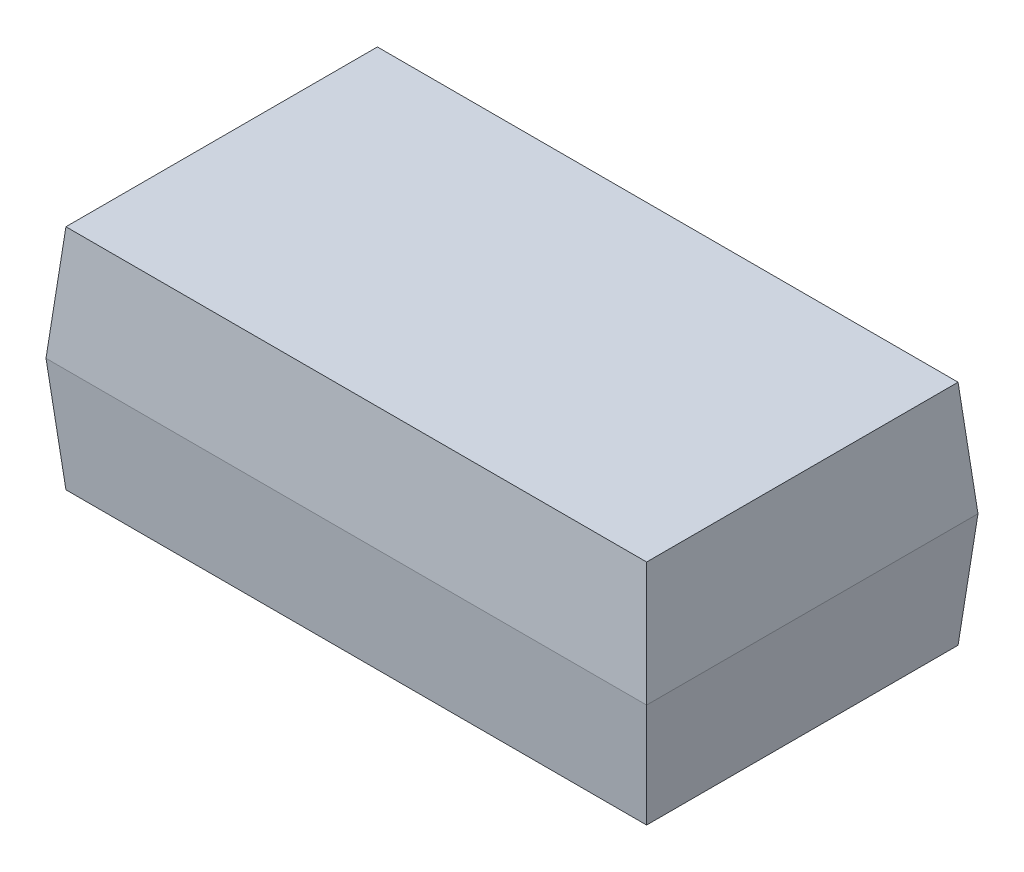
ISO-10303-21;
HEADER;
FILE_DESCRIPTION(('STEP AP214'),'2;1');
FILE_NAME('part.step','',(''),(''),'','','');
FILE_SCHEMA(('AUTOMOTIVE_DESIGN { 1 0 10303 214 1 1 1 1 }'));
ENDSEC;
DATA;
#1=APPLICATION_CONTEXT('core data for automotive mechanical design processes');
#2=APPLICATION_PROTOCOL_DEFINITION('international standard','automotive_design',2000,#1);
#3=PRODUCT_CONTEXT('',#1,'mechanical');
#4=PRODUCT('Part','Part','',(#3));
#5=PRODUCT_RELATED_PRODUCT_CATEGORY('part','',(#4));
#6=PRODUCT_DEFINITION_FORMATION('','',#4);
#7=PRODUCT_DEFINITION_CONTEXT('part definition',#1,'design');
#8=PRODUCT_DEFINITION('design','',#6,#7);
#9=PRODUCT_DEFINITION_SHAPE('','',#8);
#10=(LENGTH_UNIT() NAMED_UNIT(*) SI_UNIT(.MILLI.,.METRE.));
#11=(NAMED_UNIT(*) PLANE_ANGLE_UNIT() SI_UNIT($,.RADIAN.));
#12=(NAMED_UNIT(*) SI_UNIT($,.STERADIAN.) SOLID_ANGLE_UNIT());
#13=UNCERTAINTY_MEASURE_WITH_UNIT(LENGTH_MEASURE(1.E-05),#10,'distance_accuracy_value','');
#14=(GEOMETRIC_REPRESENTATION_CONTEXT(3) GLOBAL_UNCERTAINTY_ASSIGNED_CONTEXT((#13)) GLOBAL_UNIT_ASSIGNED_CONTEXT((#10,
#11,#12)) REPRESENTATION_CONTEXT('',''));
#15=CARTESIAN_POINT('',(0.,0.,0.));
#16=DIRECTION('',(0.,0.,1.));
#17=DIRECTION('',(1.,0.,0.));
#18=AXIS2_PLACEMENT_3D('',#15,#16,#17);
#19=CARTESIAN_POINT('',(-73.75121955751,21.838670418366,23.741835900099));
#20=DIRECTION('',(0.,1.,0.));
#21=DIRECTION('',(0.,0.,1.));
#22=AXIS2_PLACEMENT_3D('',#19,#20,#21);
#23=PLANE('',#22);
#24=DIRECTION('',(1.,0.,0.));
#25=VECTOR('',#24,1.);
#26=CARTESIAN_POINT('',(-73.75121955751,21.838670418366,22.1899546650382));
#27=LINE('',#26,#25);
#28=CARTESIAN_POINT('',(-70.8993383224496,21.838670418366,22.1899546650381));
#29=VERTEX_POINT('',#28);
#30=CARTESIAN_POINT('',(-73.7031007925702,21.838670418366,22.1899546650381));
#31=VERTEX_POINT('',#30);
#32=EDGE_CURVE('E95',#29,#31,#27,.F.);
#33=ORIENTED_EDGE('',*,*,#32,.F.);
#34=DIRECTION('',(0.,0.,1.));
#35=VECTOR('',#34,1.);
#36=CARTESIAN_POINT('',(-70.8993383224493,21.8386704183659,22.141835900099));
#37=LINE('',#36,#35);
#38=CARTESIAN_POINT('',(-70.8993383224498,21.838670418366,23.6937171351599));
#39=VERTEX_POINT('',#38);
#40=EDGE_CURVE('E81',#39,#29,#37,.F.);
#41=ORIENTED_EDGE('',*,*,#40,.F.);
#42=DIRECTION('',(1.,0.,0.));
#43=VECTOR('',#42,1.);
#44=CARTESIAN_POINT('',(-73.75121955751,21.838670418366,23.6937171351598));
#45=LINE('',#44,#43);
#46=CARTESIAN_POINT('',(-73.7031007925704,21.838670418366,23.6937171351599));
#47=VERTEX_POINT('',#46);
#48=EDGE_CURVE('E68',#47,#39,#45,.T.);
#49=ORIENTED_EDGE('',*,*,#48,.F.);
#50=DIRECTION('',(0.,0.,1.));
#51=VECTOR('',#50,1.);
#52=CARTESIAN_POINT('',(-73.7031007925708,21.8386704183659,22.141835900099));
#53=LINE('',#52,#51);
#54=EDGE_CURVE('E20',#31,#47,#53,.T.);
#55=ORIENTED_EDGE('',*,*,#54,.F.);
#56=EDGE_LOOP('',(#33,#41,#49,#55));
#57=FACE_BOUND('',#56,.T.);
#58=ADVANCED_FACE('F17',(#57),#23,.F.);
#59=CARTESIAN_POINT('',(-73.75121955751,22.388670418366,22.141835900099));
#60=DIRECTION('',(-0.996194698091747,-0.0871557427476379,0.));
#61=DIRECTION('',(0.0871557427476379,-0.996194698091747,0.));
#62=AXIS2_PLACEMENT_3D('',#59,#60,#61);
#63=PLANE('',#62);
#64=ORIENTED_EDGE('',*,*,#54,.T.);
#65=DIRECTION('',(0.0868265938655792,-0.992432509138854,-0.0868265938642144));
#66=VECTOR('',#65,1.);
#67=CARTESIAN_POINT('',(-73.75121955751,22.388670418366,23.741835900099));
#68=LINE('',#67,#66);
#69=CARTESIAN_POINT('',(-73.75121955751,22.388670418366,23.741835900099));
#70=VERTEX_POINT('',#69);
#71=EDGE_CURVE('E74',#70,#47,#68,.T.);
#72=ORIENTED_EDGE('',*,*,#71,.F.);
#73=DIRECTION('',(0.,0.,1.));
#74=VECTOR('',#73,1.);
#75=CARTESIAN_POINT('',(-73.75121955751,22.388670418366,22.141835900099));
#76=LINE('',#75,#74);
#77=CARTESIAN_POINT('',(-73.75121955751,22.388670418366,22.141835900099));
#78=VERTEX_POINT('',#77);
#79=EDGE_CURVE('E98',#78,#70,#76,.T.);
#80=ORIENTED_EDGE('',*,*,#79,.F.);
#81=DIRECTION('',(-0.0868265938655792,0.992432509138854,-0.0868265938642144));
#82=VECTOR('',#81,1.);
#83=CARTESIAN_POINT('',(-73.70310079257,21.838670418366,22.1899546650382));
#84=LINE('',#83,#82);
#85=EDGE_CURVE('E77',#31,#78,#84,.T.);
#86=ORIENTED_EDGE('',*,*,#85,.F.);
#87=EDGE_LOOP('',(#64,#72,#80,#86));
#88=FACE_BOUND('',#87,.T.);
#89=ADVANCED_FACE('F73',(#88),#63,.T.);
#90=CARTESIAN_POINT('',(-73.75121955751,22.388670418366,23.741835900099));
#91=DIRECTION('',(0.,-0.0871557427476379,0.996194698091747));
#92=DIRECTION('',(0.,-0.996194698091747,-0.0871557427476379));
#93=AXIS2_PLACEMENT_3D('',#90,#91,#92);
#94=PLANE('',#93);
#95=ORIENTED_EDGE('',*,*,#48,.T.);
#96=DIRECTION('',(-0.0868265938642269,-0.99243250913901,-0.0868265938637762));
#97=VECTOR('',#96,1.);
#98=CARTESIAN_POINT('',(-70.85121955751,22.388670418366,23.741835900099));
#99=LINE('',#98,#97);
#100=CARTESIAN_POINT('',(-70.85121955751,22.388670418366,23.741835900099));
#101=VERTEX_POINT('',#100);
#102=EDGE_CURVE('E83',#101,#39,#99,.T.);
#103=ORIENTED_EDGE('',*,*,#102,.F.);
#104=DIRECTION('',(1.,0.,0.));
#105=VECTOR('',#104,1.);
#106=CARTESIAN_POINT('',(-73.75121955751,22.388670418366,23.741835900099));
#107=LINE('',#106,#105);
#108=EDGE_CURVE('E87',#70,#101,#107,.T.);
#109=ORIENTED_EDGE('',*,*,#108,.F.);
#110=ORIENTED_EDGE('',*,*,#71,.T.);
#111=EDGE_LOOP('',(#95,#103,#109,#110));
#112=FACE_BOUND('',#111,.T.);
#113=ADVANCED_FACE('F85',(#112),#94,.T.);
#114=CARTESIAN_POINT('',(-70.85121955751,22.388670418366,22.141835900099));
#115=DIRECTION('',(0.996194698091747,-0.0871557427476379,0.));
#116=DIRECTION('',(0.0871557427476379,0.996194698091747,0.));
#117=AXIS2_PLACEMENT_3D('',#114,#115,#116);
#118=PLANE('',#117);
#119=ORIENTED_EDGE('',*,*,#40,.T.);
#120=DIRECTION('',(-0.0868265938655792,-0.992432509138854,0.0868265938642144));
#121=VECTOR('',#120,1.);
#122=CARTESIAN_POINT('',(-70.85121955751,22.388670418366,22.141835900099));
#123=LINE('',#122,#121);
#124=CARTESIAN_POINT('',(-70.85121955751,22.388670418366,22.141835900099));
#125=VERTEX_POINT('',#124);
#126=EDGE_CURVE('E92',#125,#29,#123,.T.);
#127=ORIENTED_EDGE('',*,*,#126,.F.);
#128=DIRECTION('',(0.,0.,1.));
#129=VECTOR('',#128,1.);
#130=CARTESIAN_POINT('',(-70.85121955751,22.388670418366,22.141835900099));
#131=LINE('',#130,#129);
#132=EDGE_CURVE('E104',#101,#125,#131,.F.);
#133=ORIENTED_EDGE('',*,*,#132,.F.);
#134=ORIENTED_EDGE('',*,*,#102,.T.);
#135=EDGE_LOOP('',(#119,#127,#133,#134));
#136=FACE_BOUND('',#135,.T.);
#137=ADVANCED_FACE('F137',(#136),#118,.T.);
#138=CARTESIAN_POINT('',(-73.75121955751,22.388670418366,22.141835900099));
#139=DIRECTION('',(0.,-0.0871557427476379,-0.996194698091747));
#140=DIRECTION('',(0.,0.996194698091747,-0.0871557427476379));
#141=AXIS2_PLACEMENT_3D('',#138,#139,#140);
#142=PLANE('',#141);
#143=ORIENTED_EDGE('',*,*,#32,.T.);
#144=ORIENTED_EDGE('',*,*,#85,.T.);
#145=DIRECTION('',(1.,0.,0.));
#146=VECTOR('',#145,1.);
#147=CARTESIAN_POINT('',(-73.75121955751,22.388670418366,22.141835900099));
#148=LINE('',#147,#146);
#149=EDGE_CURVE('E109',#125,#78,#148,.F.);
#150=ORIENTED_EDGE('',*,*,#149,.F.);
#151=ORIENTED_EDGE('',*,*,#126,.T.);
#152=EDGE_LOOP('',(#143,#144,#150,#151));
#153=FACE_BOUND('',#152,.T.);
#154=ADVANCED_FACE('F135',(#153),#142,.T.);
#155=CARTESIAN_POINT('',(-73.75121955751,22.388670418366,22.141835900099));
#156=DIRECTION('',(-0.996194698091747,0.0871557427476379,0.));
#157=DIRECTION('',(-0.0871557427476379,-0.996194698091747,0.));
#158=AXIS2_PLACEMENT_3D('',#155,#156,#157);
#159=PLANE('',#158);
#160=DIRECTION('',(0.,0.,1.));
#161=VECTOR('',#160,1.);
#162=CARTESIAN_POINT('',(-73.70310079257,22.938670418366,23.741835900099));
#163=LINE('',#162,#161);
#164=CARTESIAN_POINT('',(-73.7031007925704,22.938670418366,22.1899546650381));
#165=VERTEX_POINT('',#164);
#166=CARTESIAN_POINT('',(-73.7031007925704,22.938670418366,23.6937171351599));
#167=VERTEX_POINT('',#166);
#168=EDGE_CURVE('E116',#165,#167,#163,.T.);
#169=ORIENTED_EDGE('',*,*,#168,.F.);
#170=DIRECTION('',(0.0868265938655792,0.992432509138854,0.0868265938642144));
#171=VECTOR('',#170,1.);
#172=CARTESIAN_POINT('',(-73.75121955751,22.388670418366,22.141835900099));
#173=LINE('',#172,#171);
#174=EDGE_CURVE('E112',#78,#165,#173,.T.);
#175=ORIENTED_EDGE('',*,*,#174,.F.);
#176=ORIENTED_EDGE('',*,*,#79,.T.);
#177=DIRECTION('',(-0.0868265938655792,-0.992432509138854,0.0868265938642144));
#178=VECTOR('',#177,1.);
#179=CARTESIAN_POINT('',(-73.70310079257,22.938670418366,23.6937171351598));
#180=LINE('',#179,#178);
#181=EDGE_CURVE('E101',#167,#70,#180,.T.);
#182=ORIENTED_EDGE('',*,*,#181,.F.);
#183=EDGE_LOOP('',(#169,#175,#176,#182));
#184=FACE_BOUND('',#183,.T.);
#185=ADVANCED_FACE('F131',(#184),#159,.T.);
#186=CARTESIAN_POINT('',(-73.75121955751,22.388670418366,23.741835900099));
#187=DIRECTION('',(0.,0.0871557427476379,0.996194698091747));
#188=DIRECTION('',(0.,-0.996194698091747,0.0871557427476379));
#189=AXIS2_PLACEMENT_3D('',#186,#187,#188);
#190=PLANE('',#189);
#191=DIRECTION('',(1.,0.,0.));
#192=VECTOR('',#191,1.);
#193=CARTESIAN_POINT('',(-73.75121955751,22.938670418366,23.69371713516));
#194=LINE('',#193,#192);
#195=CARTESIAN_POINT('',(-70.8993383224498,22.938670418366,23.6937171351599));
#196=VERTEX_POINT('',#195);
#197=EDGE_CURVE('E119',#167,#196,#194,.T.);
#198=ORIENTED_EDGE('',*,*,#197,.F.);
#199=ORIENTED_EDGE('',*,*,#181,.T.);
#200=ORIENTED_EDGE('',*,*,#108,.T.);
#201=DIRECTION('',(0.0868265938642269,-0.99243250913901,0.0868265938637762));
#202=VECTOR('',#201,1.);
#203=CARTESIAN_POINT('',(-70.8993383224493,22.9386704183661,23.69371713516));
#204=LINE('',#203,#202);
#205=EDGE_CURVE('E106',#196,#101,#204,.T.);
#206=ORIENTED_EDGE('',*,*,#205,.F.);
#207=EDGE_LOOP('',(#198,#199,#200,#206));
#208=FACE_BOUND('',#207,.T.);
#209=ADVANCED_FACE('F129',(#208),#190,.T.);
#210=CARTESIAN_POINT('',(-70.85121955751,22.388670418366,22.141835900099));
#211=DIRECTION('',(0.996194698091747,0.0871557427476379,0.));
#212=DIRECTION('',(-0.0871557427476379,0.996194698091747,0.));
#213=AXIS2_PLACEMENT_3D('',#210,#211,#212);
#214=PLANE('',#213);
#215=DIRECTION('',(0.,0.,1.));
#216=VECTOR('',#215,1.);
#217=CARTESIAN_POINT('',(-70.89933832245,22.938670418366,23.741835900099));
#218=LINE('',#217,#216);
#219=CARTESIAN_POINT('',(-70.8993383224496,22.938670418366,22.1899546650381));
#220=VERTEX_POINT('',#219);
#221=EDGE_CURVE('E26',#196,#220,#218,.F.);
#222=ORIENTED_EDGE('',*,*,#221,.F.);
#223=ORIENTED_EDGE('',*,*,#205,.T.);
#224=ORIENTED_EDGE('',*,*,#132,.T.);
#225=DIRECTION('',(0.0868265938655792,-0.992432509138854,-0.0868265938642144));
#226=VECTOR('',#225,1.);
#227=CARTESIAN_POINT('',(-70.89933832245,22.938670418366,22.1899546650382));
#228=LINE('',#227,#226);
#229=EDGE_CURVE('E35',#220,#125,#228,.T.);
#230=ORIENTED_EDGE('',*,*,#229,.F.);
#231=EDGE_LOOP('',(#222,#223,#224,#230));
#232=FACE_BOUND('',#231,.T.);
#233=ADVANCED_FACE('F126',(#232),#214,.T.);
#234=CARTESIAN_POINT('',(-73.75121955751,22.388670418366,22.141835900099));
#235=DIRECTION('',(0.,0.0871557427476379,-0.996194698091747));
#236=DIRECTION('',(0.,0.996194698091747,0.0871557427476379));
#237=AXIS2_PLACEMENT_3D('',#234,#235,#236);
#238=PLANE('',#237);
#239=DIRECTION('',(1.,0.,0.));
#240=VECTOR('',#239,1.);
#241=CARTESIAN_POINT('',(-73.75121955751,22.938670418366,22.189954665038));
#242=LINE('',#241,#240);
#243=EDGE_CURVE('E11',#220,#165,#242,.F.);
#244=ORIENTED_EDGE('',*,*,#243,.F.);
#245=ORIENTED_EDGE('',*,*,#229,.T.);
#246=ORIENTED_EDGE('',*,*,#149,.T.);
#247=ORIENTED_EDGE('',*,*,#174,.T.);
#248=EDGE_LOOP('',(#244,#245,#246,#247));
#249=FACE_BOUND('',#248,.T.);
#250=ADVANCED_FACE('F148',(#249),#238,.T.);
#251=CARTESIAN_POINT('',(-73.75121955751,22.938670418366,23.741835900099));
#252=DIRECTION('',(0.,1.,0.));
#253=DIRECTION('',(0.,0.,1.));
#254=AXIS2_PLACEMENT_3D('',#251,#252,#253);
#255=PLANE('',#254);
#256=ORIENTED_EDGE('',*,*,#221,.T.);
#257=ORIENTED_EDGE('',*,*,#243,.T.);
#258=ORIENTED_EDGE('',*,*,#168,.T.);
#259=ORIENTED_EDGE('',*,*,#197,.T.);
#260=EDGE_LOOP('',(#256,#257,#258,#259));
#261=FACE_BOUND('',#260,.T.);
#262=ADVANCED_FACE('F124',(#261),#255,.T.);
#263=CLOSED_SHELL('',(#58,#89,#113,#137,#154,#185,#209,#233,#250,#262));
#264=MANIFOLD_SOLID_BREP('B1',#263);
#265=ADVANCED_BREP_SHAPE_REPRESENTATION('',(#18,#264),#14);
#266=SHAPE_DEFINITION_REPRESENTATION(#9,#265);
ENDSEC;
END-ISO-10303-21;
